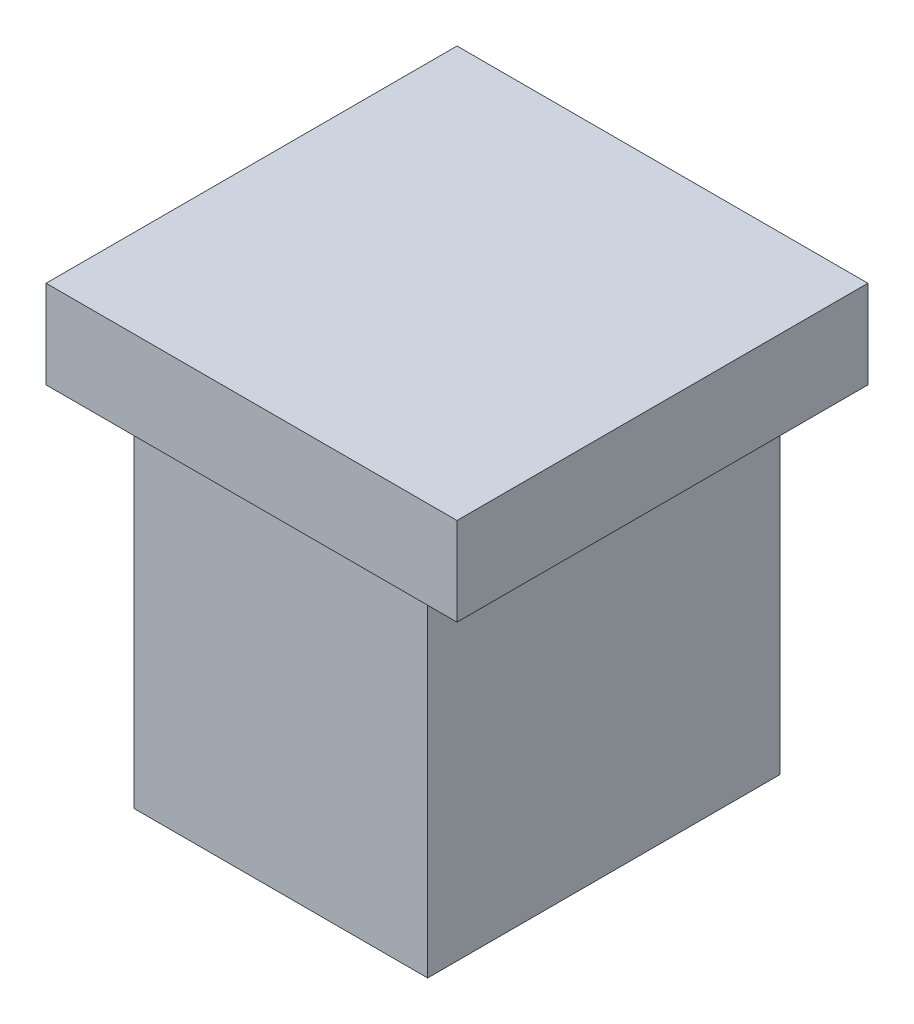
ISO-10303-21;
HEADER;
FILE_DESCRIPTION(('STEP AP214'),'2;1');
FILE_NAME('part.step','',(''),(''),'','','');
FILE_SCHEMA(('AUTOMOTIVE_DESIGN { 1 0 10303 214 1 1 1 1 }'));
ENDSEC;
DATA;
#1=APPLICATION_CONTEXT('core data for automotive mechanical design processes');
#2=APPLICATION_PROTOCOL_DEFINITION('international standard','automotive_design',2000,#1);
#3=PRODUCT_CONTEXT('',#1,'mechanical');
#4=PRODUCT('Part','Part','',(#3));
#5=PRODUCT_RELATED_PRODUCT_CATEGORY('part','',(#4));
#6=PRODUCT_DEFINITION_FORMATION('','',#4);
#7=PRODUCT_DEFINITION_CONTEXT('part definition',#1,'design');
#8=PRODUCT_DEFINITION('design','',#6,#7);
#9=PRODUCT_DEFINITION_SHAPE('','',#8);
#10=(LENGTH_UNIT() NAMED_UNIT(*) SI_UNIT(.MILLI.,.METRE.));
#11=(NAMED_UNIT(*) PLANE_ANGLE_UNIT() SI_UNIT($,.RADIAN.));
#12=(NAMED_UNIT(*) SI_UNIT($,.STERADIAN.) SOLID_ANGLE_UNIT());
#13=UNCERTAINTY_MEASURE_WITH_UNIT(LENGTH_MEASURE(1.E-05),#10,'distance_accuracy_value','');
#14=(GEOMETRIC_REPRESENTATION_CONTEXT(3) GLOBAL_UNCERTAINTY_ASSIGNED_CONTEXT((#13)) GLOBAL_UNIT_ASSIGNED_CONTEXT((#10,
#11,#12)) REPRESENTATION_CONTEXT('',''));
#15=CARTESIAN_POINT('',(0.,0.,0.));
#16=DIRECTION('',(0.,0.,1.));
#17=DIRECTION('',(1.,0.,0.));
#18=AXIS2_PLACEMENT_3D('',#15,#16,#17);
#19=CARTESIAN_POINT('',(5.,12.,6.));
#20=DIRECTION('',(0.,0.,1.));
#21=DIRECTION('',(1.,0.,0.));
#22=AXIS2_PLACEMENT_3D('',#19,#20,#21);
#23=PLANE('',#22);
#24=DIRECTION('',(-1.,0.,0.));
#25=VECTOR('',#24,1.);
#26=CARTESIAN_POINT('',(5.,0.,6.));
#27=LINE('',#26,#25);
#28=CARTESIAN_POINT('',(5.,0.,6.));
#29=VERTEX_POINT('',#28);
#30=CARTESIAN_POINT('',(-5.,0.,6.));
#31=VERTEX_POINT('',#30);
#32=EDGE_CURVE('E132',#29,#31,#27,.T.);
#33=ORIENTED_EDGE('',*,*,#32,.F.);
#34=DIRECTION('',(0.,-1.,0.));
#35=VECTOR('',#34,1.);
#36=CARTESIAN_POINT('',(5.,12.,6.));
#37=LINE('',#36,#35);
#38=CARTESIAN_POINT('',(5.,12.,6.));
#39=VERTEX_POINT('',#38);
#40=EDGE_CURVE('E11',#39,#29,#37,.T.);
#41=ORIENTED_EDGE('',*,*,#40,.F.);
#42=DIRECTION('',(-1.,0.,0.));
#43=VECTOR('',#42,1.);
#44=CARTESIAN_POINT('',(5.,12.,6.));
#45=LINE('',#44,#43);
#46=CARTESIAN_POINT('',(-5.,12.,6.));
#47=VERTEX_POINT('',#46);
#48=EDGE_CURVE('E163',#39,#47,#45,.T.);
#49=ORIENTED_EDGE('',*,*,#48,.T.);
#50=DIRECTION('',(0.,-1.,0.));
#51=VECTOR('',#50,1.);
#52=CARTESIAN_POINT('',(-5.,12.,6.));
#53=LINE('',#52,#51);
#54=EDGE_CURVE('E42',#47,#31,#53,.T.);
#55=ORIENTED_EDGE('',*,*,#54,.T.);
#56=EDGE_LOOP('',(#33,#41,#49,#55));
#57=FACE_BOUND('',#56,.T.);
#58=ADVANCED_FACE('F39',(#57),#23,.T.);
#59=CARTESIAN_POINT('',(5.,12.,-6.));
#60=DIRECTION('',(1.,0.,0.));
#61=DIRECTION('',(0.,0.,-1.));
#62=AXIS2_PLACEMENT_3D('',#59,#60,#61);
#63=PLANE('',#62);
#64=DIRECTION('',(0.,0.,1.));
#65=VECTOR('',#64,1.);
#66=CARTESIAN_POINT('',(5.,0.,-6.));
#67=LINE('',#66,#65);
#68=CARTESIAN_POINT('',(5.,0.,-6.));
#69=VERTEX_POINT('',#68);
#70=EDGE_CURVE('E167',#69,#29,#67,.T.);
#71=ORIENTED_EDGE('',*,*,#70,.F.);
#72=DIRECTION('',(0.,-1.,0.));
#73=VECTOR('',#72,1.);
#74=CARTESIAN_POINT('',(5.,12.,-6.));
#75=LINE('',#74,#73);
#76=CARTESIAN_POINT('',(5.,12.,-6.));
#77=VERTEX_POINT('',#76);
#78=EDGE_CURVE('E49',#77,#69,#75,.T.);
#79=ORIENTED_EDGE('',*,*,#78,.F.);
#80=DIRECTION('',(0.,0.,1.));
#81=VECTOR('',#80,1.);
#82=CARTESIAN_POINT('',(5.,12.,-6.));
#83=LINE('',#82,#81);
#84=EDGE_CURVE('E175',#77,#39,#83,.T.);
#85=ORIENTED_EDGE('',*,*,#84,.T.);
#86=ORIENTED_EDGE('',*,*,#40,.T.);
#87=EDGE_LOOP('',(#71,#79,#85,#86));
#88=FACE_BOUND('',#87,.T.);
#89=ADVANCED_FACE('F201',(#88),#63,.T.);
#90=CARTESIAN_POINT('',(5.,12.,-6.));
#91=DIRECTION('',(0.,0.,1.));
#92=DIRECTION('',(1.,0.,0.));
#93=AXIS2_PLACEMENT_3D('',#90,#91,#92);
#94=PLANE('',#93);
#95=DIRECTION('',(-1.,0.,0.));
#96=VECTOR('',#95,1.);
#97=CARTESIAN_POINT('',(5.,0.,-6.));
#98=LINE('',#97,#96);
#99=CARTESIAN_POINT('',(-5.,0.,-6.));
#100=VERTEX_POINT('',#99);
#101=EDGE_CURVE('E185',#69,#100,#98,.T.);
#102=ORIENTED_EDGE('',*,*,#101,.T.);
#103=DIRECTION('',(0.,-1.,0.));
#104=VECTOR('',#103,1.);
#105=CARTESIAN_POINT('',(-5.,12.,-6.));
#106=LINE('',#105,#104);
#107=CARTESIAN_POINT('',(-5.,12.,-6.));
#108=VERTEX_POINT('',#107);
#109=EDGE_CURVE('E78',#108,#100,#106,.T.);
#110=ORIENTED_EDGE('',*,*,#109,.F.);
#111=DIRECTION('',(-1.,0.,0.));
#112=VECTOR('',#111,1.);
#113=CARTESIAN_POINT('',(5.,12.,-6.));
#114=LINE('',#113,#112);
#115=EDGE_CURVE('E171',#77,#108,#114,.T.);
#116=ORIENTED_EDGE('',*,*,#115,.F.);
#117=ORIENTED_EDGE('',*,*,#78,.T.);
#118=EDGE_LOOP('',(#102,#110,#116,#117));
#119=FACE_BOUND('',#118,.T.);
#120=ADVANCED_FACE('F203',(#119),#94,.F.);
#121=CARTESIAN_POINT('',(-5.,12.,-6.));
#122=DIRECTION('',(1.,0.,0.));
#123=DIRECTION('',(0.,0.,-1.));
#124=AXIS2_PLACEMENT_3D('',#121,#122,#123);
#125=PLANE('',#124);
#126=DIRECTION('',(0.,0.,1.));
#127=VECTOR('',#126,1.);
#128=CARTESIAN_POINT('',(-5.,0.,-6.));
#129=LINE('',#128,#127);
#130=EDGE_CURVE('E181',#100,#31,#129,.T.);
#131=ORIENTED_EDGE('',*,*,#130,.T.);
#132=ORIENTED_EDGE('',*,*,#54,.F.);
#133=DIRECTION('',(0.,0.,1.));
#134=VECTOR('',#133,1.);
#135=CARTESIAN_POINT('',(-5.,12.,-6.));
#136=LINE('',#135,#134);
#137=EDGE_CURVE('E166',#108,#47,#136,.T.);
#138=ORIENTED_EDGE('',*,*,#137,.F.);
#139=ORIENTED_EDGE('',*,*,#109,.T.);
#140=EDGE_LOOP('',(#131,#132,#138,#139));
#141=FACE_BOUND('',#140,.T.);
#142=ADVANCED_FACE('F198',(#141),#125,.F.);
#143=CARTESIAN_POINT('',(0.,0.,0.));
#144=DIRECTION('',(0.,1.,0.));
#145=DIRECTION('',(0.,0.,1.));
#146=AXIS2_PLACEMENT_3D('',#143,#144,#145);
#147=PLANE('',#146);
#148=ORIENTED_EDGE('',*,*,#32,.T.);
#149=ORIENTED_EDGE('',*,*,#130,.F.);
#150=ORIENTED_EDGE('',*,*,#101,.F.);
#151=ORIENTED_EDGE('',*,*,#70,.T.);
#152=EDGE_LOOP('',(#148,#149,#150,#151));
#153=FACE_BOUND('',#152,.T.);
#154=ADVANCED_FACE('F200',(#153),#147,.F.);
#155=CARTESIAN_POINT('',(0.,12.,0.));
#156=DIRECTION('',(0.,-1.,0.));
#157=DIRECTION('',(0.,0.,-1.));
#158=AXIS2_PLACEMENT_3D('',#155,#156,#157);
#159=PLANE('',#158);
#160=DIRECTION('',(0.,0.,-1.));
#161=VECTOR('',#160,1.);
#162=CARTESIAN_POINT('',(7.,12.,0.));
#163=LINE('',#162,#161);
#164=CARTESIAN_POINT('',(7.,12.,7.));
#165=VERTEX_POINT('',#164);
#166=CARTESIAN_POINT('',(7.,12.,-7.));
#167=VERTEX_POINT('',#166);
#168=EDGE_CURVE('E127',#165,#167,#163,.T.);
#169=ORIENTED_EDGE('',*,*,#168,.F.);
#170=DIRECTION('',(1.,0.,0.));
#171=VECTOR('',#170,1.);
#172=CARTESIAN_POINT('',(0.,12.,7.));
#173=LINE('',#172,#171);
#174=CARTESIAN_POINT('',(-7.,12.,7.));
#175=VERTEX_POINT('',#174);
#176=EDGE_CURVE('E121',#175,#165,#173,.T.);
#177=ORIENTED_EDGE('',*,*,#176,.F.);
#178=DIRECTION('',(0.,0.,-1.));
#179=VECTOR('',#178,1.);
#180=CARTESIAN_POINT('',(-7.,12.,0.));
#181=LINE('',#180,#179);
#182=CARTESIAN_POINT('',(-7.,12.,-7.));
#183=VERTEX_POINT('',#182);
#184=EDGE_CURVE('E150',#175,#183,#181,.T.);
#185=ORIENTED_EDGE('',*,*,#184,.T.);
#186=DIRECTION('',(1.,0.,0.));
#187=VECTOR('',#186,1.);
#188=CARTESIAN_POINT('',(0.,12.,-7.));
#189=LINE('',#188,#187);
#190=EDGE_CURVE('E147',#183,#167,#189,.T.);
#191=ORIENTED_EDGE('',*,*,#190,.T.);
#192=EDGE_LOOP('',(#169,#177,#185,#191));
#193=FACE_BOUND('',#192,.T.);
#194=ORIENTED_EDGE('',*,*,#48,.F.);
#195=ORIENTED_EDGE('',*,*,#84,.F.);
#196=ORIENTED_EDGE('',*,*,#115,.T.);
#197=ORIENTED_EDGE('',*,*,#137,.T.);
#198=EDGE_LOOP('',(#194,#195,#196,#197));
#199=FACE_BOUND('',#198,.T.);
#200=ADVANCED_FACE('F205',(#193,#199),#159,.T.);
#201=CARTESIAN_POINT('',(7.,15.,0.));
#202=DIRECTION('',(-1.,0.,0.));
#203=DIRECTION('',(0.,0.,1.));
#204=AXIS2_PLACEMENT_3D('',#201,#202,#203);
#205=PLANE('',#204);
#206=ORIENTED_EDGE('',*,*,#168,.T.);
#207=DIRECTION('',(0.,-1.,0.));
#208=VECTOR('',#207,1.);
#209=CARTESIAN_POINT('',(7.,15.,-7.));
#210=LINE('',#209,#208);
#211=CARTESIAN_POINT('',(7.,15.,-7.));
#212=VERTEX_POINT('',#211);
#213=EDGE_CURVE('E124',#212,#167,#210,.T.);
#214=ORIENTED_EDGE('',*,*,#213,.F.);
#215=DIRECTION('',(0.,0.,-1.));
#216=VECTOR('',#215,1.);
#217=CARTESIAN_POINT('',(7.,15.,0.));
#218=LINE('',#217,#216);
#219=CARTESIAN_POINT('',(7.,15.,7.));
#220=VERTEX_POINT('',#219);
#221=EDGE_CURVE('E108',#220,#212,#218,.T.);
#222=ORIENTED_EDGE('',*,*,#221,.F.);
#223=DIRECTION('',(0.,-1.,0.));
#224=VECTOR('',#223,1.);
#225=CARTESIAN_POINT('',(7.,15.,7.));
#226=LINE('',#225,#224);
#227=EDGE_CURVE('E144',#220,#165,#226,.T.);
#228=ORIENTED_EDGE('',*,*,#227,.T.);
#229=EDGE_LOOP('',(#206,#214,#222,#228));
#230=FACE_BOUND('',#229,.T.);
#231=ADVANCED_FACE('F125',(#230),#205,.F.);
#232=CARTESIAN_POINT('',(0.,15.,-7.));
#233=DIRECTION('',(0.,0.,-1.));
#234=DIRECTION('',(-1.,0.,0.));
#235=AXIS2_PLACEMENT_3D('',#232,#233,#234);
#236=PLANE('',#235);
#237=ORIENTED_EDGE('',*,*,#190,.F.);
#238=DIRECTION('',(0.,-1.,0.));
#239=VECTOR('',#238,1.);
#240=CARTESIAN_POINT('',(-7.,15.,-7.));
#241=LINE('',#240,#239);
#242=CARTESIAN_POINT('',(-7.,15.,-7.));
#243=VERTEX_POINT('',#242);
#244=EDGE_CURVE('E133',#243,#183,#241,.T.);
#245=ORIENTED_EDGE('',*,*,#244,.F.);
#246=DIRECTION('',(1.,0.,0.));
#247=VECTOR('',#246,1.);
#248=CARTESIAN_POINT('',(0.,15.,-7.));
#249=LINE('',#248,#247);
#250=EDGE_CURVE('E113',#243,#212,#249,.T.);
#251=ORIENTED_EDGE('',*,*,#250,.T.);
#252=ORIENTED_EDGE('',*,*,#213,.T.);
#253=EDGE_LOOP('',(#237,#245,#251,#252));
#254=FACE_BOUND('',#253,.T.);
#255=ADVANCED_FACE('F135',(#254),#236,.T.);
#256=CARTESIAN_POINT('',(-7.,15.,0.));
#257=DIRECTION('',(-1.,0.,0.));
#258=DIRECTION('',(0.,0.,1.));
#259=AXIS2_PLACEMENT_3D('',#256,#257,#258);
#260=PLANE('',#259);
#261=ORIENTED_EDGE('',*,*,#184,.F.);
#262=DIRECTION('',(0.,-1.,0.));
#263=VECTOR('',#262,1.);
#264=CARTESIAN_POINT('',(-7.,15.,7.));
#265=LINE('',#264,#263);
#266=CARTESIAN_POINT('',(-7.,15.,7.));
#267=VERTEX_POINT('',#266);
#268=EDGE_CURVE('E158',#267,#175,#265,.T.);
#269=ORIENTED_EDGE('',*,*,#268,.F.);
#270=DIRECTION('',(0.,0.,-1.));
#271=VECTOR('',#270,1.);
#272=CARTESIAN_POINT('',(-7.,15.,0.));
#273=LINE('',#272,#271);
#274=EDGE_CURVE('E137',#267,#243,#273,.T.);
#275=ORIENTED_EDGE('',*,*,#274,.T.);
#276=ORIENTED_EDGE('',*,*,#244,.T.);
#277=EDGE_LOOP('',(#261,#269,#275,#276));
#278=FACE_BOUND('',#277,.T.);
#279=ADVANCED_FACE('F268',(#278),#260,.T.);
#280=CARTESIAN_POINT('',(0.,15.,7.));
#281=DIRECTION('',(0.,0.,-1.));
#282=DIRECTION('',(-1.,0.,0.));
#283=AXIS2_PLACEMENT_3D('',#280,#281,#282);
#284=PLANE('',#283);
#285=ORIENTED_EDGE('',*,*,#176,.T.);
#286=ORIENTED_EDGE('',*,*,#227,.F.);
#287=DIRECTION('',(1.,0.,0.));
#288=VECTOR('',#287,1.);
#289=CARTESIAN_POINT('',(0.,15.,7.));
#290=LINE('',#289,#288);
#291=EDGE_CURVE('E116',#267,#220,#290,.T.);
#292=ORIENTED_EDGE('',*,*,#291,.F.);
#293=ORIENTED_EDGE('',*,*,#268,.T.);
#294=EDGE_LOOP('',(#285,#286,#292,#293));
#295=FACE_BOUND('',#294,.T.);
#296=ADVANCED_FACE('F276',(#295),#284,.F.);
#297=CARTESIAN_POINT('',(0.,15.,0.));
#298=DIRECTION('',(0.,-1.,0.));
#299=DIRECTION('',(0.,0.,-1.));
#300=AXIS2_PLACEMENT_3D('',#297,#298,#299);
#301=PLANE('',#300);
#302=ORIENTED_EDGE('',*,*,#221,.T.);
#303=ORIENTED_EDGE('',*,*,#250,.F.);
#304=ORIENTED_EDGE('',*,*,#274,.F.);
#305=ORIENTED_EDGE('',*,*,#291,.T.);
#306=EDGE_LOOP('',(#302,#303,#304,#305));
#307=FACE_BOUND('',#306,.T.);
#308=ADVANCED_FACE('F110',(#307),#301,.F.);
#309=CLOSED_SHELL('',(#58,#89,#120,#142,#154,#200,#231,#255,#279,#296,#308));
#310=MANIFOLD_SOLID_BREP('B2',#309);
#311=ADVANCED_BREP_SHAPE_REPRESENTATION('',(#18,#310),#14);
#312=SHAPE_DEFINITION_REPRESENTATION(#9,#311);
ENDSEC;
END-ISO-10303-21;
